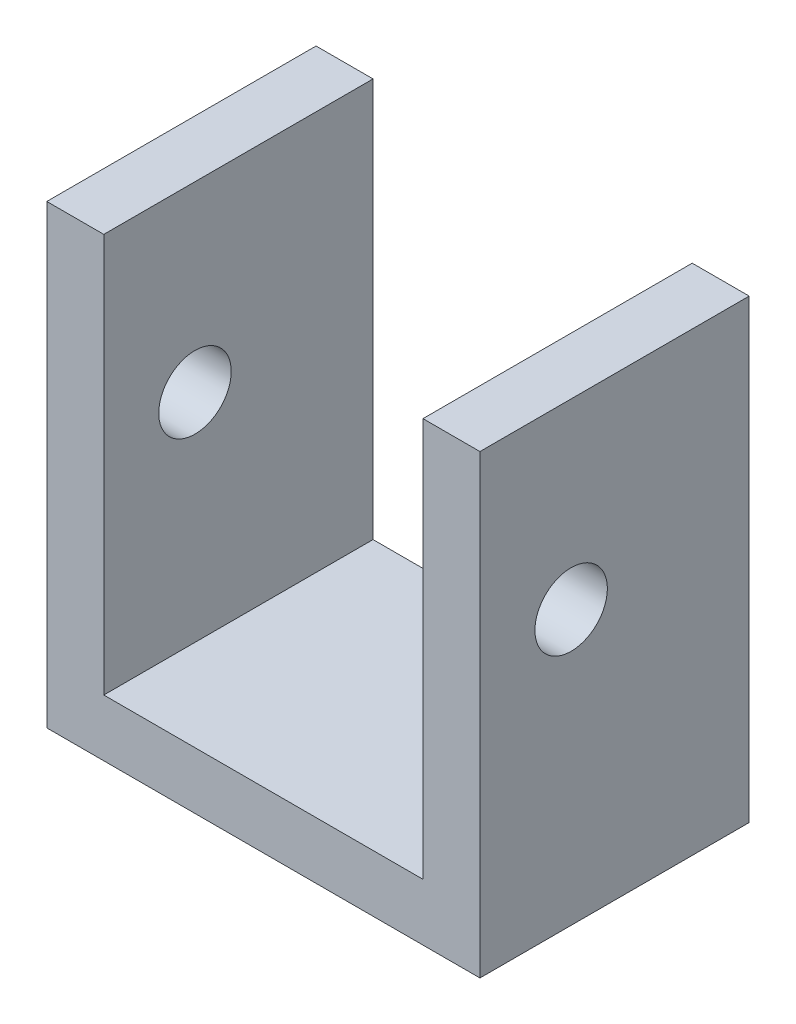
ISO-10303-21;
HEADER;
FILE_DESCRIPTION(('STEP AP214'),'2;1');
FILE_NAME('part.step','',(''),(''),'','','');
FILE_SCHEMA(('AUTOMOTIVE_DESIGN { 1 0 10303 214 1 1 1 1 }'));
ENDSEC;
DATA;
#1=APPLICATION_CONTEXT('core data for automotive mechanical design processes');
#2=APPLICATION_PROTOCOL_DEFINITION('international standard','automotive_design',2000,#1);
#3=PRODUCT_CONTEXT('',#1,'mechanical');
#4=PRODUCT('Part','Part','',(#3));
#5=PRODUCT_RELATED_PRODUCT_CATEGORY('part','',(#4));
#6=PRODUCT_DEFINITION_FORMATION('','',#4);
#7=PRODUCT_DEFINITION_CONTEXT('part definition',#1,'design');
#8=PRODUCT_DEFINITION('design','',#6,#7);
#9=PRODUCT_DEFINITION_SHAPE('','',#8);
#10=(LENGTH_UNIT() NAMED_UNIT(*) SI_UNIT(.MILLI.,.METRE.));
#11=(NAMED_UNIT(*) PLANE_ANGLE_UNIT() SI_UNIT($,.RADIAN.));
#12=(NAMED_UNIT(*) SI_UNIT($,.STERADIAN.) SOLID_ANGLE_UNIT());
#13=UNCERTAINTY_MEASURE_WITH_UNIT(LENGTH_MEASURE(1.E-05),#10,'distance_accuracy_value','');
#14=(GEOMETRIC_REPRESENTATION_CONTEXT(3) GLOBAL_UNCERTAINTY_ASSIGNED_CONTEXT((#13)) GLOBAL_UNIT_ASSIGNED_CONTEXT((#10,
#11,#12)) REPRESENTATION_CONTEXT('',''));
#15=CARTESIAN_POINT('',(0.,0.,0.));
#16=DIRECTION('',(0.,0.,1.));
#17=DIRECTION('',(1.,0.,0.));
#18=AXIS2_PLACEMENT_3D('',#15,#16,#17);
#19=CARTESIAN_POINT('',(0.,25.4,15.));
#20=DIRECTION('',(0.,1.,0.));
#21=DIRECTION('',(-1.,0.,0.));
#22=AXIS2_PLACEMENT_3D('',#19,#20,#21);
#23=PLANE('',#22);
#24=DIRECTION('',(1.,0.,0.));
#25=VECTOR('',#24,1.);
#26=CARTESIAN_POINT('',(0.,25.4,0.));
#27=LINE('',#26,#25);
#28=CARTESIAN_POINT('',(8.89,25.4,0.));
#29=VERTEX_POINT('',#28);
#30=CARTESIAN_POINT('',(12.065,25.4,0.));
#31=VERTEX_POINT('',#30);
#32=EDGE_CURVE('E134',#29,#31,#27,.T.);
#33=ORIENTED_EDGE('',*,*,#32,.F.);
#34=DIRECTION('',(0.,0.,-1.));
#35=VECTOR('',#34,1.);
#36=CARTESIAN_POINT('',(8.89,25.4,15.));
#37=LINE('',#36,#35);
#38=CARTESIAN_POINT('',(8.89,25.4,15.));
#39=VERTEX_POINT('',#38);
#40=EDGE_CURVE('E11',#39,#29,#37,.T.);
#41=ORIENTED_EDGE('',*,*,#40,.F.);
#42=DIRECTION('',(1.,0.,0.));
#43=VECTOR('',#42,1.);
#44=CARTESIAN_POINT('',(0.,25.4,15.));
#45=LINE('',#44,#43);
#46=CARTESIAN_POINT('',(12.065,25.4,15.));
#47=VERTEX_POINT('',#46);
#48=EDGE_CURVE('E153',#39,#47,#45,.T.);
#49=ORIENTED_EDGE('',*,*,#48,.T.);
#50=DIRECTION('',(0.,0.,-1.));
#51=VECTOR('',#50,1.);
#52=CARTESIAN_POINT('',(12.065,25.4,15.));
#53=LINE('',#52,#51);
#54=EDGE_CURVE('E56',#47,#31,#53,.T.);
#55=ORIENTED_EDGE('',*,*,#54,.T.);
#56=EDGE_LOOP('',(#33,#41,#49,#55));
#57=FACE_BOUND('',#56,.T.);
#58=ADVANCED_FACE('F39',(#57),#23,.T.);
#59=CARTESIAN_POINT('',(8.89,0.,15.));
#60=DIRECTION('',(1.,0.,0.));
#61=DIRECTION('',(0.,1.,0.));
#62=AXIS2_PLACEMENT_3D('',#59,#60,#61);
#63=PLANE('',#62);
#64=CARTESIAN_POINT('',(8.89,15.24,9.92));
#65=DIRECTION('',(1.,0.,0.));
#66=DIRECTION('',(0.,1.,0.));
#67=AXIS2_PLACEMENT_3D('',#64,#65,#66);
#68=CIRCLE('',#67,2.0193);
#69=CARTESIAN_POINT('',(8.89,17.2593,9.92));
#70=VERTEX_POINT('',#69);
#71=EDGE_CURVE('E137',#70,#70,#68,.T.);
#72=ORIENTED_EDGE('',*,*,#71,.T.);
#73=EDGE_LOOP('',(#72));
#74=FACE_BOUND('',#73,.T.);
#75=DIRECTION('',(0.,-1.,0.));
#76=VECTOR('',#75,1.);
#77=CARTESIAN_POINT('',(8.89,0.,0.));
#78=LINE('',#77,#76);
#79=CARTESIAN_POINT('',(8.89,3.175,0.));
#80=VERTEX_POINT('',#79);
#81=EDGE_CURVE('E136',#29,#80,#78,.T.);
#82=ORIENTED_EDGE('',*,*,#81,.T.);
#83=DIRECTION('',(0.,0.,-1.));
#84=VECTOR('',#83,1.);
#85=CARTESIAN_POINT('',(8.89,3.175,15.));
#86=LINE('',#85,#84);
#87=CARTESIAN_POINT('',(8.89,3.175,15.));
#88=VERTEX_POINT('',#87);
#89=EDGE_CURVE('E48',#88,#80,#86,.T.);
#90=ORIENTED_EDGE('',*,*,#89,.F.);
#91=DIRECTION('',(0.,-1.,0.));
#92=VECTOR('',#91,1.);
#93=CARTESIAN_POINT('',(8.89,0.,15.));
#94=LINE('',#93,#92);
#95=EDGE_CURVE('E178',#39,#88,#94,.T.);
#96=ORIENTED_EDGE('',*,*,#95,.F.);
#97=ORIENTED_EDGE('',*,*,#40,.T.);
#98=EDGE_LOOP('',(#82,#90,#96,#97));
#99=FACE_BOUND('',#98,.T.);
#100=ADVANCED_FACE('F41',(#74,#99),#63,.F.);
#101=CARTESIAN_POINT('',(0.,3.175,15.));
#102=DIRECTION('',(0.,1.,0.));
#103=DIRECTION('',(0.,0.,1.));
#104=AXIS2_PLACEMENT_3D('',#101,#102,#103);
#105=PLANE('',#104);
#106=DIRECTION('',(1.,0.,0.));
#107=VECTOR('',#106,1.);
#108=CARTESIAN_POINT('',(0.,3.175,0.));
#109=LINE('',#108,#107);
#110=CARTESIAN_POINT('',(-8.89,3.175,0.));
#111=VERTEX_POINT('',#110);
#112=EDGE_CURVE('E141',#111,#80,#109,.T.);
#113=ORIENTED_EDGE('',*,*,#112,.F.);
#114=DIRECTION('',(0.,0.,-1.));
#115=VECTOR('',#114,1.);
#116=CARTESIAN_POINT('',(-8.89,3.175,15.));
#117=LINE('',#116,#115);
#118=CARTESIAN_POINT('',(-8.89,3.175,15.));
#119=VERTEX_POINT('',#118);
#120=EDGE_CURVE('E159',#119,#111,#117,.T.);
#121=ORIENTED_EDGE('',*,*,#120,.F.);
#122=DIRECTION('',(1.,0.,0.));
#123=VECTOR('',#122,1.);
#124=CARTESIAN_POINT('',(0.,3.175,15.));
#125=LINE('',#124,#123);
#126=EDGE_CURVE('E166',#119,#88,#125,.T.);
#127=ORIENTED_EDGE('',*,*,#126,.T.);
#128=ORIENTED_EDGE('',*,*,#89,.T.);
#129=EDGE_LOOP('',(#113,#121,#127,#128));
#130=FACE_BOUND('',#129,.T.);
#131=ADVANCED_FACE('F164',(#130),#105,.T.);
#132=CARTESIAN_POINT('',(-8.89,0.,15.));
#133=DIRECTION('',(1.,0.,0.));
#134=DIRECTION('',(0.,1.,0.));
#135=AXIS2_PLACEMENT_3D('',#132,#133,#134);
#136=PLANE('',#135);
#137=CARTESIAN_POINT('',(-8.89,15.24,9.92));
#138=DIRECTION('',(1.,0.,0.));
#139=DIRECTION('',(0.,1.,0.));
#140=AXIS2_PLACEMENT_3D('',#137,#138,#139);
#141=CIRCLE('',#140,2.0193);
#142=CARTESIAN_POINT('',(-8.89,17.2593,9.92));
#143=VERTEX_POINT('',#142);
#144=EDGE_CURVE('E185',#143,#143,#141,.T.);
#145=ORIENTED_EDGE('',*,*,#144,.F.);
#146=EDGE_LOOP('',(#145));
#147=FACE_BOUND('',#146,.T.);
#148=DIRECTION('',(0.,-1.,0.));
#149=VECTOR('',#148,1.);
#150=CARTESIAN_POINT('',(-8.89,0.,0.));
#151=LINE('',#150,#149);
#152=CARTESIAN_POINT('',(-8.89,25.4,0.));
#153=VERTEX_POINT('',#152);
#154=EDGE_CURVE('E144',#153,#111,#151,.T.);
#155=ORIENTED_EDGE('',*,*,#154,.F.);
#156=DIRECTION('',(0.,0.,-1.));
#157=VECTOR('',#156,1.);
#158=CARTESIAN_POINT('',(-8.89,25.4,15.));
#159=LINE('',#158,#157);
#160=CARTESIAN_POINT('',(-8.89,25.4,15.));
#161=VERTEX_POINT('',#160);
#162=EDGE_CURVE('E157',#161,#153,#159,.T.);
#163=ORIENTED_EDGE('',*,*,#162,.F.);
#164=DIRECTION('',(0.,-1.,0.));
#165=VECTOR('',#164,1.);
#166=CARTESIAN_POINT('',(-8.89,0.,15.));
#167=LINE('',#166,#165);
#168=EDGE_CURVE('E177',#161,#119,#167,.T.);
#169=ORIENTED_EDGE('',*,*,#168,.T.);
#170=ORIENTED_EDGE('',*,*,#120,.T.);
#171=EDGE_LOOP('',(#155,#163,#169,#170));
#172=FACE_BOUND('',#171,.T.);
#173=ADVANCED_FACE('F175',(#147,#172),#136,.T.);
#174=CARTESIAN_POINT('',(-12.065,25.4,0.));
#175=VERTEX_POINT('',#174);
#176=EDGE_CURVE('E138',#175,#153,#27,.T.);
#177=ORIENTED_EDGE('',*,*,#176,.F.);
#178=DIRECTION('',(0.,0.,-1.));
#179=VECTOR('',#178,1.);
#180=CARTESIAN_POINT('',(-12.065,25.4,15.));
#181=LINE('',#180,#179);
#182=CARTESIAN_POINT('',(-12.065,25.4,15.));
#183=VERTEX_POINT('',#182);
#184=EDGE_CURVE('E126',#183,#175,#181,.T.);
#185=ORIENTED_EDGE('',*,*,#184,.F.);
#186=EDGE_CURVE('E116',#183,#161,#45,.T.);
#187=ORIENTED_EDGE('',*,*,#186,.T.);
#188=ORIENTED_EDGE('',*,*,#162,.T.);
#189=EDGE_LOOP('',(#177,#185,#187,#188));
#190=FACE_BOUND('',#189,.T.);
#191=ADVANCED_FACE('F203',(#190),#23,.T.);
#192=CARTESIAN_POINT('',(-12.065,0.,15.));
#193=DIRECTION('',(1.,0.,0.));
#194=DIRECTION('',(0.,1.,0.));
#195=AXIS2_PLACEMENT_3D('',#192,#193,#194);
#196=PLANE('',#195);
#197=CARTESIAN_POINT('',(-12.065,15.24,9.92));
#198=DIRECTION('',(1.,0.,0.));
#199=DIRECTION('',(0.,0.,-1.));
#200=AXIS2_PLACEMENT_3D('',#197,#198,#199);
#201=CIRCLE('',#200,2.01929999999999);
#202=CARTESIAN_POINT('',(-12.065,15.24,7.9007));
#203=VERTEX_POINT('',#202);
#204=EDGE_CURVE('E188',#203,#203,#201,.T.);
#205=ORIENTED_EDGE('',*,*,#204,.T.);
#206=EDGE_LOOP('',(#205));
#207=FACE_BOUND('',#206,.T.);
#208=DIRECTION('',(0.,-1.,0.));
#209=VECTOR('',#208,1.);
#210=CARTESIAN_POINT('',(-12.065,0.,0.));
#211=LINE('',#210,#209);
#212=CARTESIAN_POINT('',(-12.065,0.,0.));
#213=VERTEX_POINT('',#212);
#214=EDGE_CURVE('E123',#175,#213,#211,.T.);
#215=ORIENTED_EDGE('',*,*,#214,.T.);
#216=DIRECTION('',(0.,0.,-1.));
#217=VECTOR('',#216,1.);
#218=CARTESIAN_POINT('',(-12.065,0.,15.));
#219=LINE('',#218,#217);
#220=CARTESIAN_POINT('',(-12.065,0.,15.));
#221=VERTEX_POINT('',#220);
#222=EDGE_CURVE('E120',#221,#213,#219,.T.);
#223=ORIENTED_EDGE('',*,*,#222,.F.);
#224=DIRECTION('',(0.,-1.,0.));
#225=VECTOR('',#224,1.);
#226=CARTESIAN_POINT('',(-12.065,0.,15.));
#227=LINE('',#226,#225);
#228=EDGE_CURVE('E107',#183,#221,#227,.T.);
#229=ORIENTED_EDGE('',*,*,#228,.F.);
#230=ORIENTED_EDGE('',*,*,#184,.T.);
#231=EDGE_LOOP('',(#215,#223,#229,#230));
#232=FACE_BOUND('',#231,.T.);
#233=ADVANCED_FACE('F121',(#207,#232),#196,.F.);
#234=CARTESIAN_POINT('',(0.,0.,15.));
#235=DIRECTION('',(0.,1.,0.));
#236=DIRECTION('',(-1.,0.,0.));
#237=AXIS2_PLACEMENT_3D('',#234,#235,#236);
#238=PLANE('',#237);
#239=DIRECTION('',(1.,0.,0.));
#240=VECTOR('',#239,1.);
#241=CARTESIAN_POINT('',(0.,0.,0.));
#242=LINE('',#241,#240);
#243=CARTESIAN_POINT('',(12.065,0.,0.));
#244=VERTEX_POINT('',#243);
#245=EDGE_CURVE('E148',#213,#244,#242,.T.);
#246=ORIENTED_EDGE('',*,*,#245,.T.);
#247=DIRECTION('',(0.,0.,-1.));
#248=VECTOR('',#247,1.);
#249=CARTESIAN_POINT('',(12.065,0.,15.));
#250=LINE('',#249,#248);
#251=CARTESIAN_POINT('',(12.065,0.,15.));
#252=VERTEX_POINT('',#251);
#253=EDGE_CURVE('E82',#252,#244,#250,.T.);
#254=ORIENTED_EDGE('',*,*,#253,.F.);
#255=DIRECTION('',(1.,0.,0.));
#256=VECTOR('',#255,1.);
#257=CARTESIAN_POINT('',(0.,0.,15.));
#258=LINE('',#257,#256);
#259=EDGE_CURVE('E113',#221,#252,#258,.T.);
#260=ORIENTED_EDGE('',*,*,#259,.F.);
#261=ORIENTED_EDGE('',*,*,#222,.T.);
#262=EDGE_LOOP('',(#246,#254,#260,#261));
#263=FACE_BOUND('',#262,.T.);
#264=ADVANCED_FACE('F128',(#263),#238,.F.);
#265=CARTESIAN_POINT('',(12.065,0.,15.));
#266=DIRECTION('',(1.,0.,0.));
#267=DIRECTION('',(0.,1.,0.));
#268=AXIS2_PLACEMENT_3D('',#265,#266,#267);
#269=PLANE('',#268);
#270=CARTESIAN_POINT('',(12.065,15.24,9.92));
#271=DIRECTION('',(1.,0.,0.));
#272=DIRECTION('',(0.,0.,-1.));
#273=AXIS2_PLACEMENT_3D('',#270,#271,#272);
#274=CIRCLE('',#273,2.0193);
#275=CARTESIAN_POINT('',(12.065,15.24,7.9007));
#276=VERTEX_POINT('',#275);
#277=EDGE_CURVE('E191',#276,#276,#274,.T.);
#278=ORIENTED_EDGE('',*,*,#277,.F.);
#279=EDGE_LOOP('',(#278));
#280=FACE_BOUND('',#279,.T.);
#281=DIRECTION('',(0.,-1.,0.));
#282=VECTOR('',#281,1.);
#283=CARTESIAN_POINT('',(12.065,0.,0.));
#284=LINE('',#283,#282);
#285=EDGE_CURVE('E150',#31,#244,#284,.T.);
#286=ORIENTED_EDGE('',*,*,#285,.F.);
#287=ORIENTED_EDGE('',*,*,#54,.F.);
#288=DIRECTION('',(0.,-1.,0.));
#289=VECTOR('',#288,1.);
#290=CARTESIAN_POINT('',(12.065,0.,15.));
#291=LINE('',#290,#289);
#292=EDGE_CURVE('E129',#47,#252,#291,.T.);
#293=ORIENTED_EDGE('',*,*,#292,.T.);
#294=ORIENTED_EDGE('',*,*,#253,.T.);
#295=EDGE_LOOP('',(#286,#287,#293,#294));
#296=FACE_BOUND('',#295,.T.);
#297=ADVANCED_FACE('F198',(#280,#296),#269,.T.);
#298=CARTESIAN_POINT('',(0.,0.,15.));
#299=DIRECTION('',(0.,0.,1.));
#300=DIRECTION('',(1.,0.,0.));
#301=AXIS2_PLACEMENT_3D('',#298,#299,#300);
#302=PLANE('',#301);
#303=ORIENTED_EDGE('',*,*,#48,.F.);
#304=ORIENTED_EDGE('',*,*,#95,.T.);
#305=ORIENTED_EDGE('',*,*,#126,.F.);
#306=ORIENTED_EDGE('',*,*,#168,.F.);
#307=ORIENTED_EDGE('',*,*,#186,.F.);
#308=ORIENTED_EDGE('',*,*,#228,.T.);
#309=ORIENTED_EDGE('',*,*,#259,.T.);
#310=ORIENTED_EDGE('',*,*,#292,.F.);
#311=EDGE_LOOP('',(#303,#304,#305,#306,#307,#308,#309,#310));
#312=FACE_BOUND('',#311,.T.);
#313=ADVANCED_FACE('F110',(#312),#302,.T.);
#314=CARTESIAN_POINT('',(0.,0.,0.));
#315=DIRECTION('',(0.,0.,1.));
#316=DIRECTION('',(1.,0.,0.));
#317=AXIS2_PLACEMENT_3D('',#314,#315,#316);
#318=PLANE('',#317);
#319=ORIENTED_EDGE('',*,*,#32,.T.);
#320=ORIENTED_EDGE('',*,*,#285,.T.);
#321=ORIENTED_EDGE('',*,*,#245,.F.);
#322=ORIENTED_EDGE('',*,*,#214,.F.);
#323=ORIENTED_EDGE('',*,*,#176,.T.);
#324=ORIENTED_EDGE('',*,*,#154,.T.);
#325=ORIENTED_EDGE('',*,*,#112,.T.);
#326=ORIENTED_EDGE('',*,*,#81,.F.);
#327=EDGE_LOOP('',(#319,#320,#321,#322,#323,#324,#325,#326));
#328=FACE_BOUND('',#327,.T.);
#329=ADVANCED_FACE('F170',(#328),#318,.F.);
#330=CARTESIAN_POINT('',(12.065,15.24,9.92));
#331=DIRECTION('',(1.,0.,0.));
#332=DIRECTION('',(0.,0.,-1.));
#333=AXIS2_PLACEMENT_3D('',#330,#331,#332);
#334=CYLINDRICAL_SURFACE('',#333,2.0193);
#335=ORIENTED_EDGE('',*,*,#277,.T.);
#336=EDGE_LOOP('',(#335));
#337=FACE_BOUND('',#336,.T.);
#338=ORIENTED_EDGE('',*,*,#71,.F.);
#339=EDGE_LOOP('',(#338));
#340=FACE_BOUND('',#339,.T.);
#341=ADVANCED_FACE('F195',(#337,#340),#334,.F.);
#342=ORIENTED_EDGE('',*,*,#144,.T.);
#343=EDGE_LOOP('',(#342));
#344=FACE_BOUND('',#343,.T.);
#345=ORIENTED_EDGE('',*,*,#204,.F.);
#346=EDGE_LOOP('',(#345));
#347=FACE_BOUND('',#346,.T.);
#348=ADVANCED_FACE('F223',(#344,#347),#334,.F.);
#349=CLOSED_SHELL('',(#58,#100,#131,#173,#191,#233,#264,#297,#313,#329,#341,#348));
#350=MANIFOLD_SOLID_BREP('B2',#349);
#351=ADVANCED_BREP_SHAPE_REPRESENTATION('',(#18,#350),#14);
#352=SHAPE_DEFINITION_REPRESENTATION(#9,#351);
ENDSEC;
END-ISO-10303-21;
